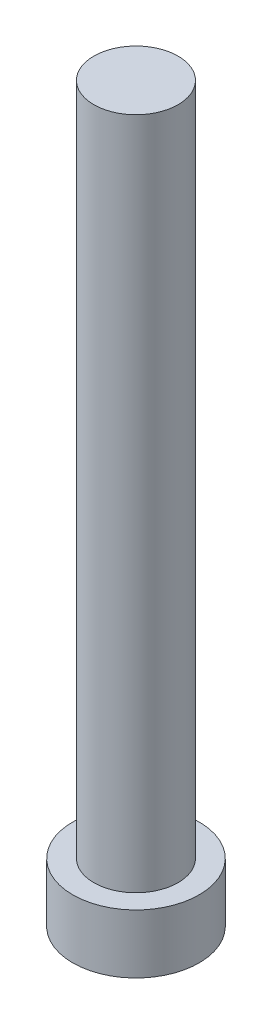
ISO-10303-21;
HEADER;
FILE_DESCRIPTION(('STEP AP214'),'2;1');
FILE_NAME('part.step','',(''),(''),'','','');
FILE_SCHEMA(('AUTOMOTIVE_DESIGN { 1 0 10303 214 1 1 1 1 }'));
ENDSEC;
DATA;
#1=APPLICATION_CONTEXT('core data for automotive mechanical design processes');
#2=APPLICATION_PROTOCOL_DEFINITION('international standard','automotive_design',2000,#1);
#3=PRODUCT_CONTEXT('',#1,'mechanical');
#4=PRODUCT('Part','Part','',(#3));
#5=PRODUCT_RELATED_PRODUCT_CATEGORY('part','',(#4));
#6=PRODUCT_DEFINITION_FORMATION('','',#4);
#7=PRODUCT_DEFINITION_CONTEXT('part definition',#1,'design');
#8=PRODUCT_DEFINITION('design','',#6,#7);
#9=PRODUCT_DEFINITION_SHAPE('','',#8);
#10=(LENGTH_UNIT() NAMED_UNIT(*) SI_UNIT(.MILLI.,.METRE.));
#11=(NAMED_UNIT(*) PLANE_ANGLE_UNIT() SI_UNIT($,.RADIAN.));
#12=(NAMED_UNIT(*) SI_UNIT($,.STERADIAN.) SOLID_ANGLE_UNIT());
#13=UNCERTAINTY_MEASURE_WITH_UNIT(LENGTH_MEASURE(1.E-05),#10,'distance_accuracy_value','');
#14=(GEOMETRIC_REPRESENTATION_CONTEXT(3) GLOBAL_UNCERTAINTY_ASSIGNED_CONTEXT((#13)) GLOBAL_UNIT_ASSIGNED_CONTEXT((#10,
#11,#12)) REPRESENTATION_CONTEXT('',''));
#15=CARTESIAN_POINT('',(0.,0.,0.));
#16=DIRECTION('',(0.,0.,1.));
#17=DIRECTION('',(1.,0.,0.));
#18=AXIS2_PLACEMENT_3D('',#15,#16,#17);
#19=CARTESIAN_POINT('',(0.,3.5,0.));
#20=DIRECTION('',(0.,-1.,0.));
#21=DIRECTION('',(0.,0.,-1.));
#22=AXIS2_PLACEMENT_3D('',#19,#20,#21);
#23=CYLINDRICAL_SURFACE('',#22,3.75);
#24=CARTESIAN_POINT('',(0.,3.5,0.));
#25=DIRECTION('',(0.,1.,0.));
#26=DIRECTION('',(0.,0.,1.));
#27=AXIS2_PLACEMENT_3D('',#24,#25,#26);
#28=CIRCLE('',#27,3.75);
#29=CARTESIAN_POINT('',(0.,3.5,3.75));
#30=VERTEX_POINT('',#29);
#31=EDGE_CURVE('E38',#30,#30,#28,.T.);
#32=ORIENTED_EDGE('',*,*,#31,.F.);
#33=EDGE_LOOP('',(#32));
#34=FACE_BOUND('',#33,.T.);
#35=CARTESIAN_POINT('',(0.,0.,0.));
#36=DIRECTION('',(0.,1.,0.));
#37=DIRECTION('',(0.,0.,1.));
#38=AXIS2_PLACEMENT_3D('',#35,#36,#37);
#39=CIRCLE('',#38,3.75);
#40=CARTESIAN_POINT('',(0.,0.,3.75));
#41=VERTEX_POINT('',#40);
#42=EDGE_CURVE('E34',#41,#41,#39,.T.);
#43=ORIENTED_EDGE('',*,*,#42,.T.);
#44=EDGE_LOOP('',(#43));
#45=FACE_BOUND('',#44,.T.);
#46=ADVANCED_FACE('F31',(#34,#45),#23,.T.);
#47=CARTESIAN_POINT('',(0.,3.5,0.));
#48=DIRECTION('',(0.,1.,0.));
#49=DIRECTION('',(0.,0.,1.));
#50=AXIS2_PLACEMENT_3D('',#47,#48,#49);
#51=PLANE('',#50);
#52=CARTESIAN_POINT('',(0.,3.5,0.));
#53=DIRECTION('',(0.,1.,0.));
#54=DIRECTION('',(0.,0.,1.));
#55=AXIS2_PLACEMENT_3D('',#52,#53,#54);
#56=CIRCLE('',#55,2.5);
#57=CARTESIAN_POINT('',(0.,3.5,2.5));
#58=VERTEX_POINT('',#57);
#59=EDGE_CURVE('E10',#58,#58,#56,.T.);
#60=ORIENTED_EDGE('',*,*,#59,.F.);
#61=EDGE_LOOP('',(#60));
#62=FACE_BOUND('',#61,.T.);
#63=ORIENTED_EDGE('',*,*,#31,.T.);
#64=EDGE_LOOP('',(#63));
#65=FACE_BOUND('',#64,.T.);
#66=ADVANCED_FACE('F55',(#62,#65),#51,.T.);
#67=CARTESIAN_POINT('',(0.,0.,0.));
#68=DIRECTION('',(0.,1.,0.));
#69=DIRECTION('',(0.,0.,1.));
#70=AXIS2_PLACEMENT_3D('',#67,#68,#69);
#71=PLANE('',#70);
#72=ORIENTED_EDGE('',*,*,#42,.F.);
#73=EDGE_LOOP('',(#72));
#74=FACE_BOUND('',#73,.T.);
#75=ADVANCED_FACE('F52',(#74),#71,.F.);
#76=CARTESIAN_POINT('',(0.,43.5,0.));
#77=DIRECTION('',(0.,-1.,0.));
#78=DIRECTION('',(0.,0.,-1.));
#79=AXIS2_PLACEMENT_3D('',#76,#77,#78);
#80=CYLINDRICAL_SURFACE('',#79,2.5);
#81=CARTESIAN_POINT('',(0.,43.5,0.));
#82=DIRECTION('',(0.,1.,0.));
#83=DIRECTION('',(0.,0.,1.));
#84=AXIS2_PLACEMENT_3D('',#81,#82,#83);
#85=CIRCLE('',#84,2.5);
#86=CARTESIAN_POINT('',(0.,43.5,2.5));
#87=VERTEX_POINT('',#86);
#88=EDGE_CURVE('E44',#87,#87,#85,.T.);
#89=ORIENTED_EDGE('',*,*,#88,.F.);
#90=EDGE_LOOP('',(#89));
#91=FACE_BOUND('',#90,.T.);
#92=ORIENTED_EDGE('',*,*,#59,.T.);
#93=EDGE_LOOP('',(#92));
#94=FACE_BOUND('',#93,.T.);
#95=ADVANCED_FACE('F54',(#91,#94),#80,.T.);
#96=CARTESIAN_POINT('',(0.,43.5,0.));
#97=DIRECTION('',(0.,1.,0.));
#98=DIRECTION('',(0.,0.,1.));
#99=AXIS2_PLACEMENT_3D('',#96,#97,#98);
#100=PLANE('',#99);
#101=ORIENTED_EDGE('',*,*,#88,.T.);
#102=EDGE_LOOP('',(#101));
#103=FACE_BOUND('',#102,.T.);
#104=ADVANCED_FACE('F60',(#103),#100,.T.);
#105=CLOSED_SHELL('',(#46,#66,#75,#95,#104));
#106=MANIFOLD_SOLID_BREP('B2',#105);
#107=ADVANCED_BREP_SHAPE_REPRESENTATION('',(#18,#106),#14);
#108=SHAPE_DEFINITION_REPRESENTATION(#9,#107);
ENDSEC;
END-ISO-10303-21;
